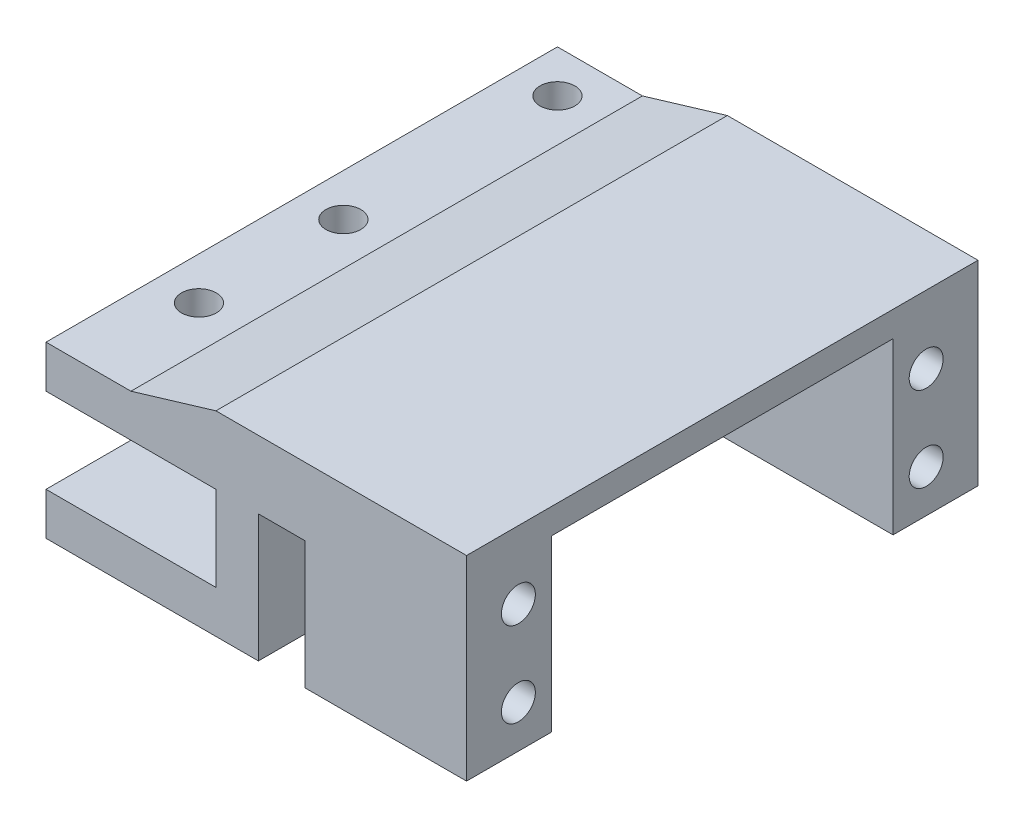
ISO-10303-21;
HEADER;
FILE_DESCRIPTION(('STEP AP214'),'2;1');
FILE_NAME('part.step','',(''),(''),'','','');
FILE_SCHEMA(('AUTOMOTIVE_DESIGN { 1 0 10303 214 1 1 1 1 }'));
ENDSEC;
DATA;
#1=APPLICATION_CONTEXT('core data for automotive mechanical design processes');
#2=APPLICATION_PROTOCOL_DEFINITION('international standard','automotive_design',2000,#1);
#3=PRODUCT_CONTEXT('',#1,'mechanical');
#4=PRODUCT('Part','Part','',(#3));
#5=PRODUCT_RELATED_PRODUCT_CATEGORY('part','',(#4));
#6=PRODUCT_DEFINITION_FORMATION('','',#4);
#7=PRODUCT_DEFINITION_CONTEXT('part definition',#1,'design');
#8=PRODUCT_DEFINITION('design','',#6,#7);
#9=PRODUCT_DEFINITION_SHAPE('','',#8);
#10=(LENGTH_UNIT() NAMED_UNIT(*) SI_UNIT(.MILLI.,.METRE.));
#11=(NAMED_UNIT(*) PLANE_ANGLE_UNIT() SI_UNIT($,.RADIAN.));
#12=(NAMED_UNIT(*) SI_UNIT($,.STERADIAN.) SOLID_ANGLE_UNIT());
#13=UNCERTAINTY_MEASURE_WITH_UNIT(LENGTH_MEASURE(1.E-05),#10,'distance_accuracy_value','');
#14=(GEOMETRIC_REPRESENTATION_CONTEXT(3) GLOBAL_UNCERTAINTY_ASSIGNED_CONTEXT((#13)) GLOBAL_UNIT_ASSIGNED_CONTEXT((#10,
#11,#12)) REPRESENTATION_CONTEXT('',''));
#15=CARTESIAN_POINT('',(0.,0.,0.));
#16=DIRECTION('',(0.,0.,1.));
#17=DIRECTION('',(1.,0.,0.));
#18=AXIS2_PLACEMENT_3D('',#15,#16,#17);
#19=CARTESIAN_POINT('',(0.,0.,10.));
#20=DIRECTION('',(0.,1.,0.));
#21=DIRECTION('',(0.,0.,1.));
#22=AXIS2_PLACEMENT_3D('',#19,#20,#21);
#23=PLANE('',#22);
#24=DIRECTION('',(-1.,0.,0.));
#25=VECTOR('',#24,1.);
#26=CARTESIAN_POINT('',(0.,0.,0.));
#27=LINE('',#26,#25);
#28=CARTESIAN_POINT('',(0.,0.,0.));
#29=VERTEX_POINT('',#28);
#30=CARTESIAN_POINT('',(-19.,0.,0.));
#31=VERTEX_POINT('',#30);
#32=EDGE_CURVE('E239',#29,#31,#27,.T.);
#33=ORIENTED_EDGE('',*,*,#32,.F.);
#34=DIRECTION('',(0.,0.,-1.));
#35=VECTOR('',#34,1.);
#36=CARTESIAN_POINT('',(0.,0.,10.));
#37=LINE('',#36,#35);
#38=CARTESIAN_POINT('',(0.,0.,10.));
#39=VERTEX_POINT('',#38);
#40=EDGE_CURVE('E205',#39,#29,#37,.T.);
#41=ORIENTED_EDGE('',*,*,#40,.F.);
#42=DIRECTION('',(-1.,0.,0.));
#43=VECTOR('',#42,1.);
#44=CARTESIAN_POINT('',(0.,0.,10.));
#45=LINE('',#44,#43);
#46=CARTESIAN_POINT('',(-19.,0.,10.));
#47=VERTEX_POINT('',#46);
#48=EDGE_CURVE('E187',#39,#47,#45,.T.);
#49=ORIENTED_EDGE('',*,*,#48,.T.);
#50=DIRECTION('',(0.,0.,1.));
#51=VECTOR('',#50,1.);
#52=CARTESIAN_POINT('',(-19.,0.,-10.));
#53=LINE('',#52,#51);
#54=EDGE_CURVE('E195',#31,#47,#53,.T.);
#55=ORIENTED_EDGE('',*,*,#54,.F.);
#56=EDGE_LOOP('',(#33,#41,#49,#55));
#57=FACE_BOUND('',#56,.T.);
#58=ADVANCED_FACE('F41',(#57),#23,.F.);
#59=CARTESIAN_POINT('',(0.,0.,0.));
#60=DIRECTION('',(0.,0.,1.));
#61=DIRECTION('',(-1.,0.,0.));
#62=AXIS2_PLACEMENT_3D('',#59,#60,#61);
#63=PLANE('',#62);
#64=DIRECTION('',(1.,0.,0.));
#65=VECTOR('',#64,1.);
#66=CARTESIAN_POINT('',(0.,15.,0.));
#67=LINE('',#66,#65);
#68=CARTESIAN_POINT('',(-24.5,15.,0.));
#69=VERTEX_POINT('',#68);
#70=CARTESIAN_POINT('',(-19.,15.,0.));
#71=VERTEX_POINT('',#70);
#72=EDGE_CURVE('E308',#69,#71,#67,.T.);
#73=ORIENTED_EDGE('',*,*,#72,.F.);
#74=DIRECTION('',(0.,1.,0.));
#75=VECTOR('',#74,1.);
#76=CARTESIAN_POINT('',(-24.5,0.,0.));
#77=LINE('',#76,#75);
#78=CARTESIAN_POINT('',(-24.5,0.,0.));
#79=VERTEX_POINT('',#78);
#80=EDGE_CURVE('E302',#79,#69,#77,.T.);
#81=ORIENTED_EDGE('',*,*,#80,.F.);
#82=CARTESIAN_POINT('',(-29.5,0.,0.));
#83=VERTEX_POINT('',#82);
#84=EDGE_CURVE('E242',#79,#83,#27,.T.);
#85=ORIENTED_EDGE('',*,*,#84,.T.);
#86=DIRECTION('',(0.,1.,0.));
#87=VECTOR('',#86,1.);
#88=CARTESIAN_POINT('',(-29.5,5.,0.));
#89=LINE('',#88,#87);
#90=CARTESIAN_POINT('',(-29.5,5.,0.));
#91=VERTEX_POINT('',#90);
#92=EDGE_CURVE('E367',#83,#91,#89,.T.);
#93=ORIENTED_EDGE('',*,*,#92,.T.);
#94=DIRECTION('',(0.,1.,0.));
#95=VECTOR('',#94,1.);
#96=CARTESIAN_POINT('',(-29.5,15.,0.));
#97=LINE('',#96,#95);
#98=CARTESIAN_POINT('',(-29.5,15.,0.));
#99=VERTEX_POINT('',#98);
#100=EDGE_CURVE('E241',#91,#99,#97,.T.);
#101=ORIENTED_EDGE('',*,*,#100,.T.);
#102=DIRECTION('',(0.,1.,0.));
#103=VECTOR('',#102,1.);
#104=CARTESIAN_POINT('',(-29.5,20.,0.));
#105=LINE('',#104,#103);
#106=CARTESIAN_POINT('',(-29.5,20.,0.));
#107=VERTEX_POINT('',#106);
#108=EDGE_CURVE('E370',#99,#107,#105,.T.);
#109=ORIENTED_EDGE('',*,*,#108,.T.);
#110=DIRECTION('',(1.,0.,0.));
#111=VECTOR('',#110,1.);
#112=CARTESIAN_POINT('',(0.,20.,0.));
#113=LINE('',#112,#111);
#114=CARTESIAN_POINT('',(0.,20.,0.));
#115=VERTEX_POINT('',#114);
#116=EDGE_CURVE('E373',#107,#115,#113,.T.);
#117=ORIENTED_EDGE('',*,*,#116,.T.);
#118=DIRECTION('',(0.,-1.,0.));
#119=VECTOR('',#118,1.);
#120=CARTESIAN_POINT('',(0.,0.,0.));
#121=LINE('',#120,#119);
#122=EDGE_CURVE('E213',#115,#29,#121,.T.);
#123=ORIENTED_EDGE('',*,*,#122,.T.);
#124=ORIENTED_EDGE('',*,*,#32,.T.);
#125=DIRECTION('',(0.,-1.,0.));
#126=VECTOR('',#125,1.);
#127=CARTESIAN_POINT('',(-19.,0.,0.));
#128=LINE('',#127,#126);
#129=EDGE_CURVE('E198',#71,#31,#128,.T.);
#130=ORIENTED_EDGE('',*,*,#129,.F.);
#131=EDGE_LOOP('',(#73,#81,#85,#93,#101,#109,#117,#123,#124,#130));
#132=FACE_BOUND('',#131,.T.);
#133=ADVANCED_FACE('F386',(#132),#63,.F.);
#134=CARTESIAN_POINT('',(-44.5,0.,-3.));
#135=DIRECTION('',(0.,1.,0.));
#136=DIRECTION('',(0.,0.,-1.));
#137=AXIS2_PLACEMENT_3D('',#134,#135,#136);
#138=CIRCLE('',#137,2.04999999999999);
#139=CARTESIAN_POINT('',(-44.5,0.,-5.04999999999999));
#140=VERTEX_POINT('',#139);
#141=EDGE_CURVE('E273',#140,#140,#138,.T.);
#142=ORIENTED_EDGE('',*,*,#141,.T.);
#143=EDGE_LOOP('',(#142));
#144=FACE_BOUND('',#143,.T.);
#145=CARTESIAN_POINT('',(-44.5,0.,-45.2));
#146=DIRECTION('',(0.,1.,0.));
#147=DIRECTION('',(0.,0.,-1.));
#148=AXIS2_PLACEMENT_3D('',#145,#146,#147);
#149=CIRCLE('',#148,2.04999999999999);
#150=CARTESIAN_POINT('',(-44.5,0.,-47.25));
#151=VERTEX_POINT('',#150);
#152=EDGE_CURVE('E443',#151,#151,#149,.T.);
#153=ORIENTED_EDGE('',*,*,#152,.T.);
#154=EDGE_LOOP('',(#153));
#155=FACE_BOUND('',#154,.T.);
#156=CARTESIAN_POINT('',(-44.5,0.,-20.));
#157=DIRECTION('',(0.,1.,0.));
#158=DIRECTION('',(0.,0.,-1.));
#159=AXIS2_PLACEMENT_3D('',#156,#157,#158);
#160=CIRCLE('',#159,2.04999999999999);
#161=CARTESIAN_POINT('',(-44.5,0.,-22.05));
#162=VERTEX_POINT('',#161);
#163=EDGE_CURVE('E446',#162,#162,#160,.T.);
#164=ORIENTED_EDGE('',*,*,#163,.T.);
#165=EDGE_LOOP('',(#164));
#166=FACE_BOUND('',#165,.T.);
#167=CARTESIAN_POINT('',(-24.5,0.,10.));
#168=VERTEX_POINT('',#167);
#169=CARTESIAN_POINT('',(-49.5,0.,10.));
#170=VERTEX_POINT('',#169);
#171=EDGE_CURVE('E207',#168,#170,#45,.T.);
#172=ORIENTED_EDGE('',*,*,#171,.T.);
#173=DIRECTION('',(0.,0.,-1.));
#174=VECTOR('',#173,1.);
#175=CARTESIAN_POINT('',(-49.5,0.,10.));
#176=LINE('',#175,#174);
#177=CARTESIAN_POINT('',(-49.5,0.,-50.2));
#178=VERTEX_POINT('',#177);
#179=EDGE_CURVE('E11',#170,#178,#176,.T.);
#180=ORIENTED_EDGE('',*,*,#179,.T.);
#181=DIRECTION('',(-1.,0.,0.));
#182=VECTOR('',#181,1.);
#183=CARTESIAN_POINT('',(0.,0.,-50.2));
#184=LINE('',#183,#182);
#185=CARTESIAN_POINT('',(0.,0.,-50.2));
#186=VERTEX_POINT('',#185);
#187=EDGE_CURVE('E320',#186,#178,#184,.T.);
#188=ORIENTED_EDGE('',*,*,#187,.F.);
#189=DIRECTION('',(0.,0.,1.));
#190=VECTOR('',#189,1.);
#191=CARTESIAN_POINT('',(0.,0.,-50.2));
#192=LINE('',#191,#190);
#193=CARTESIAN_POINT('',(0.,0.,-40.2));
#194=VERTEX_POINT('',#193);
#195=EDGE_CURVE('E349',#186,#194,#192,.T.);
#196=ORIENTED_EDGE('',*,*,#195,.T.);
#197=DIRECTION('',(-1.,0.,0.));
#198=VECTOR('',#197,1.);
#199=CARTESIAN_POINT('',(0.,0.,-40.2));
#200=LINE('',#199,#198);
#201=CARTESIAN_POINT('',(-29.5,0.,-40.2));
#202=VERTEX_POINT('',#201);
#203=EDGE_CURVE('E319',#194,#202,#200,.T.);
#204=ORIENTED_EDGE('',*,*,#203,.T.);
#205=DIRECTION('',(0.,0.,1.));
#206=VECTOR('',#205,1.);
#207=CARTESIAN_POINT('',(-29.5,0.,-20.1));
#208=LINE('',#207,#206);
#209=EDGE_CURVE('E363',#202,#83,#208,.T.);
#210=ORIENTED_EDGE('',*,*,#209,.T.);
#211=ORIENTED_EDGE('',*,*,#84,.F.);
#212=DIRECTION('',(0.,0.,1.));
#213=VECTOR('',#212,1.);
#214=CARTESIAN_POINT('',(-24.5,0.,-10.));
#215=LINE('',#214,#213);
#216=EDGE_CURVE('E202',#79,#168,#215,.T.);
#217=ORIENTED_EDGE('',*,*,#216,.T.);
#218=EDGE_LOOP('',(#172,#180,#188,#196,#204,#210,#211,#217));
#219=FACE_BOUND('',#218,.T.);
#220=ADVANCED_FACE('F43',(#144,#155,#166,#219),#23,.F.);
#221=CARTESIAN_POINT('',(-49.5,0.,10.));
#222=DIRECTION('',(1.,0.,0.));
#223=DIRECTION('',(0.,0.,1.));
#224=AXIS2_PLACEMENT_3D('',#221,#222,#223);
#225=PLANE('',#224);
#226=ORIENTED_EDGE('',*,*,#179,.F.);
#227=DIRECTION('',(0.,1.,0.));
#228=VECTOR('',#227,1.);
#229=CARTESIAN_POINT('',(-49.5,0.,10.));
#230=LINE('',#229,#228);
#231=CARTESIAN_POINT('',(-49.5,5.,10.));
#232=VERTEX_POINT('',#231);
#233=EDGE_CURVE('E206',#170,#232,#230,.T.);
#234=ORIENTED_EDGE('',*,*,#233,.T.);
#235=DIRECTION('',(0.,0.,-1.));
#236=VECTOR('',#235,1.);
#237=CARTESIAN_POINT('',(-49.5,5.,10.));
#238=LINE('',#237,#236);
#239=CARTESIAN_POINT('',(-49.5,5.,-50.2));
#240=VERTEX_POINT('',#239);
#241=EDGE_CURVE('E50',#232,#240,#238,.T.);
#242=ORIENTED_EDGE('',*,*,#241,.T.);
#243=DIRECTION('',(0.,1.,0.));
#244=VECTOR('',#243,1.);
#245=CARTESIAN_POINT('',(-49.5,0.,-50.2));
#246=LINE('',#245,#244);
#247=EDGE_CURVE('E323',#178,#240,#246,.T.);
#248=ORIENTED_EDGE('',*,*,#247,.F.);
#249=EDGE_LOOP('',(#226,#234,#242,#248));
#250=FACE_BOUND('',#249,.T.);
#251=ADVANCED_FACE('F431',(#250),#225,.F.);
#252=CARTESIAN_POINT('',(-29.5,5.,10.));
#253=DIRECTION('',(0.,-1.,0.));
#254=DIRECTION('',(-1.,0.,0.));
#255=AXIS2_PLACEMENT_3D('',#252,#253,#254);
#256=PLANE('',#255);
#257=CARTESIAN_POINT('',(-44.5,5.,-3.));
#258=DIRECTION('',(0.,1.,0.));
#259=DIRECTION('',(-1.,0.,0.));
#260=AXIS2_PLACEMENT_3D('',#257,#258,#259);
#261=CIRCLE('',#260,2.04999999999999);
#262=CARTESIAN_POINT('',(-46.55,5.,-3.));
#263=VERTEX_POINT('',#262);
#264=EDGE_CURVE('E192',#263,#263,#261,.T.);
#265=ORIENTED_EDGE('',*,*,#264,.F.);
#266=EDGE_LOOP('',(#265));
#267=FACE_BOUND('',#266,.T.);
#268=CARTESIAN_POINT('',(-44.5,5.,-45.2));
#269=DIRECTION('',(0.,1.,0.));
#270=DIRECTION('',(-1.,0.,0.));
#271=AXIS2_PLACEMENT_3D('',#268,#269,#270);
#272=CIRCLE('',#271,2.04999999999999);
#273=CARTESIAN_POINT('',(-46.55,5.,-45.2));
#274=VERTEX_POINT('',#273);
#275=EDGE_CURVE('E281',#274,#274,#272,.T.);
#276=ORIENTED_EDGE('',*,*,#275,.F.);
#277=EDGE_LOOP('',(#276));
#278=FACE_BOUND('',#277,.T.);
#279=CARTESIAN_POINT('',(-44.5,5.,-20.));
#280=DIRECTION('',(0.,1.,0.));
#281=DIRECTION('',(-1.,0.,0.));
#282=AXIS2_PLACEMENT_3D('',#279,#280,#281);
#283=CIRCLE('',#282,2.04999999999999);
#284=CARTESIAN_POINT('',(-46.55,5.,-20.));
#285=VERTEX_POINT('',#284);
#286=EDGE_CURVE('E277',#285,#285,#283,.T.);
#287=ORIENTED_EDGE('',*,*,#286,.F.);
#288=EDGE_LOOP('',(#287));
#289=FACE_BOUND('',#288,.T.);
#290=ORIENTED_EDGE('',*,*,#241,.F.);
#291=DIRECTION('',(1.,0.,0.));
#292=VECTOR('',#291,1.);
#293=CARTESIAN_POINT('',(-29.5,5.,10.));
#294=LINE('',#293,#292);
#295=CARTESIAN_POINT('',(-29.5,5.,10.));
#296=VERTEX_POINT('',#295);
#297=EDGE_CURVE('E210',#232,#296,#294,.T.);
#298=ORIENTED_EDGE('',*,*,#297,.T.);
#299=DIRECTION('',(0.,0.,-1.));
#300=VECTOR('',#299,1.);
#301=CARTESIAN_POINT('',(-29.5,5.,10.));
#302=LINE('',#301,#300);
#303=EDGE_CURVE('E265',#296,#91,#302,.T.);
#304=ORIENTED_EDGE('',*,*,#303,.T.);
#305=DIRECTION('',(0.,0.,1.));
#306=VECTOR('',#305,1.);
#307=CARTESIAN_POINT('',(-29.5,5.,-20.1));
#308=LINE('',#307,#306);
#309=CARTESIAN_POINT('',(-29.5,5.,-40.2));
#310=VERTEX_POINT('',#309);
#311=EDGE_CURVE('E365',#310,#91,#308,.T.);
#312=ORIENTED_EDGE('',*,*,#311,.F.);
#313=DIRECTION('',(0.,0.,1.));
#314=VECTOR('',#313,1.);
#315=CARTESIAN_POINT('',(-29.5,5.,-50.2));
#316=LINE('',#315,#314);
#317=CARTESIAN_POINT('',(-29.5,5.,-50.2));
#318=VERTEX_POINT('',#317);
#319=EDGE_CURVE('E360',#318,#310,#316,.T.);
#320=ORIENTED_EDGE('',*,*,#319,.F.);
#321=DIRECTION('',(1.,0.,0.));
#322=VECTOR('',#321,1.);
#323=CARTESIAN_POINT('',(-29.5,5.,-50.2));
#324=LINE('',#323,#322);
#325=EDGE_CURVE('E327',#240,#318,#324,.T.);
#326=ORIENTED_EDGE('',*,*,#325,.F.);
#327=EDGE_LOOP('',(#290,#298,#304,#312,#320,#326));
#328=FACE_BOUND('',#327,.T.);
#329=ADVANCED_FACE('F400',(#267,#278,#289,#328),#256,.F.);
#330=CARTESIAN_POINT('',(-29.5,15.,10.));
#331=DIRECTION('',(1.,0.,0.));
#332=DIRECTION('',(0.,-1.,0.));
#333=AXIS2_PLACEMENT_3D('',#330,#331,#332);
#334=PLANE('',#333);
#335=ORIENTED_EDGE('',*,*,#100,.F.);
#336=ORIENTED_EDGE('',*,*,#303,.F.);
#337=DIRECTION('',(0.,1.,0.));
#338=VECTOR('',#337,1.);
#339=CARTESIAN_POINT('',(-29.5,15.,10.));
#340=LINE('',#339,#338);
#341=CARTESIAN_POINT('',(-29.5,15.,10.));
#342=VERTEX_POINT('',#341);
#343=EDGE_CURVE('E219',#296,#342,#340,.T.);
#344=ORIENTED_EDGE('',*,*,#343,.T.);
#345=DIRECTION('',(0.,0.,-1.));
#346=VECTOR('',#345,1.);
#347=CARTESIAN_POINT('',(-29.5,15.,10.));
#348=LINE('',#347,#346);
#349=EDGE_CURVE('E262',#342,#99,#348,.T.);
#350=ORIENTED_EDGE('',*,*,#349,.T.);
#351=EDGE_LOOP('',(#335,#336,#344,#350));
#352=FACE_BOUND('',#351,.T.);
#353=ADVANCED_FACE('F402',(#352),#334,.F.);
#354=CARTESIAN_POINT('',(-49.5,15.,10.));
#355=DIRECTION('',(0.,1.,0.));
#356=DIRECTION('',(1.,0.,0.));
#357=AXIS2_PLACEMENT_3D('',#354,#355,#356);
#358=PLANE('',#357);
#359=CARTESIAN_POINT('',(-44.5,15.,-3.));
#360=DIRECTION('',(0.,-1.,0.));
#361=DIRECTION('',(1.,0.,0.));
#362=AXIS2_PLACEMENT_3D('',#359,#360,#361);
#363=CIRCLE('',#362,2.04999999999999);
#364=CARTESIAN_POINT('',(-42.45,15.,-3.));
#365=VERTEX_POINT('',#364);
#366=EDGE_CURVE('E293',#365,#365,#363,.T.);
#367=ORIENTED_EDGE('',*,*,#366,.F.);
#368=EDGE_LOOP('',(#367));
#369=FACE_BOUND('',#368,.T.);
#370=CARTESIAN_POINT('',(-44.5,15.,-45.2));
#371=DIRECTION('',(0.,-1.,0.));
#372=DIRECTION('',(1.,0.,0.));
#373=AXIS2_PLACEMENT_3D('',#370,#371,#372);
#374=CIRCLE('',#373,2.04999999999999);
#375=CARTESIAN_POINT('',(-42.45,15.,-45.2));
#376=VERTEX_POINT('',#375);
#377=EDGE_CURVE('E276',#376,#376,#374,.T.);
#378=ORIENTED_EDGE('',*,*,#377,.F.);
#379=EDGE_LOOP('',(#378));
#380=FACE_BOUND('',#379,.T.);
#381=CARTESIAN_POINT('',(-44.5,15.,-20.));
#382=DIRECTION('',(0.,-1.,0.));
#383=DIRECTION('',(1.,0.,0.));
#384=AXIS2_PLACEMENT_3D('',#381,#382,#383);
#385=CIRCLE('',#384,2.04999999999999);
#386=CARTESIAN_POINT('',(-42.45,15.,-20.));
#387=VERTEX_POINT('',#386);
#388=EDGE_CURVE('E272',#387,#387,#385,.T.);
#389=ORIENTED_EDGE('',*,*,#388,.F.);
#390=EDGE_LOOP('',(#389));
#391=FACE_BOUND('',#390,.T.);
#392=ORIENTED_EDGE('',*,*,#349,.F.);
#393=DIRECTION('',(-1.,0.,0.));
#394=VECTOR('',#393,1.);
#395=CARTESIAN_POINT('',(-49.5,15.,10.));
#396=LINE('',#395,#394);
#397=CARTESIAN_POINT('',(-49.5,15.,10.));
#398=VERTEX_POINT('',#397);
#399=EDGE_CURVE('E222',#342,#398,#396,.T.);
#400=ORIENTED_EDGE('',*,*,#399,.T.);
#401=DIRECTION('',(0.,0.,-1.));
#402=VECTOR('',#401,1.);
#403=CARTESIAN_POINT('',(-49.5,15.,10.));
#404=LINE('',#403,#402);
#405=CARTESIAN_POINT('',(-49.5,15.,-50.2));
#406=VERTEX_POINT('',#405);
#407=EDGE_CURVE('E259',#398,#406,#404,.T.);
#408=ORIENTED_EDGE('',*,*,#407,.T.);
#409=DIRECTION('',(-1.,0.,0.));
#410=VECTOR('',#409,1.);
#411=CARTESIAN_POINT('',(-49.5,15.,-50.2));
#412=LINE('',#411,#410);
#413=CARTESIAN_POINT('',(-29.5,15.,-50.2));
#414=VERTEX_POINT('',#413);
#415=EDGE_CURVE('E332',#414,#406,#412,.T.);
#416=ORIENTED_EDGE('',*,*,#415,.F.);
#417=DIRECTION('',(0.,0.,1.));
#418=VECTOR('',#417,1.);
#419=CARTESIAN_POINT('',(-29.5,15.,-50.2));
#420=LINE('',#419,#418);
#421=CARTESIAN_POINT('',(-29.5,15.,-40.2));
#422=VERTEX_POINT('',#421);
#423=EDGE_CURVE('E357',#414,#422,#420,.T.);
#424=ORIENTED_EDGE('',*,*,#423,.T.);
#425=DIRECTION('',(0.,0.,1.));
#426=VECTOR('',#425,1.);
#427=CARTESIAN_POINT('',(-29.5,15.,-20.1));
#428=LINE('',#427,#426);
#429=EDGE_CURVE('E376',#422,#99,#428,.T.);
#430=ORIENTED_EDGE('',*,*,#429,.T.);
#431=EDGE_LOOP('',(#392,#400,#408,#416,#424,#430));
#432=FACE_BOUND('',#431,.T.);
#433=ADVANCED_FACE('F410',(#369,#380,#391,#432),#358,.F.);
#434=CARTESIAN_POINT('',(-49.5,15.,10.));
#435=DIRECTION('',(1.,0.,0.));
#436=DIRECTION('',(0.,0.,1.));
#437=AXIS2_PLACEMENT_3D('',#434,#435,#436);
#438=PLANE('',#437);
#439=ORIENTED_EDGE('',*,*,#407,.F.);
#440=DIRECTION('',(0.,1.,0.));
#441=VECTOR('',#440,1.);
#442=CARTESIAN_POINT('',(-49.5,15.,10.));
#443=LINE('',#442,#441);
#444=CARTESIAN_POINT('',(-49.5,20.,10.));
#445=VERTEX_POINT('',#444);
#446=EDGE_CURVE('E225',#398,#445,#443,.T.);
#447=ORIENTED_EDGE('',*,*,#446,.T.);
#448=DIRECTION('',(0.,0.,-1.));
#449=VECTOR('',#448,1.);
#450=CARTESIAN_POINT('',(-49.5,20.,10.));
#451=LINE('',#450,#449);
#452=CARTESIAN_POINT('',(-49.5,20.,-50.2));
#453=VERTEX_POINT('',#452);
#454=EDGE_CURVE('E256',#445,#453,#451,.T.);
#455=ORIENTED_EDGE('',*,*,#454,.T.);
#456=DIRECTION('',(0.,1.,0.));
#457=VECTOR('',#456,1.);
#458=CARTESIAN_POINT('',(-49.5,15.,-50.2));
#459=LINE('',#458,#457);
#460=EDGE_CURVE('E335',#406,#453,#459,.T.);
#461=ORIENTED_EDGE('',*,*,#460,.F.);
#462=EDGE_LOOP('',(#439,#447,#455,#461));
#463=FACE_BOUND('',#462,.T.);
#464=ADVANCED_FACE('F508',(#463),#438,.F.);
#465=CARTESIAN_POINT('',(-49.5,20.,10.));
#466=DIRECTION('',(0.,-1.,0.));
#467=DIRECTION('',(0.,0.,-1.));
#468=AXIS2_PLACEMENT_3D('',#465,#466,#467);
#469=PLANE('',#468);
#470=CARTESIAN_POINT('',(-44.5,20.,-3.));
#471=DIRECTION('',(0.,1.,0.));
#472=DIRECTION('',(0.,0.,-1.));
#473=AXIS2_PLACEMENT_3D('',#470,#471,#472);
#474=CIRCLE('',#473,2.04999999999999);
#475=CARTESIAN_POINT('',(-44.5,20.,-5.04999999999999));
#476=VERTEX_POINT('',#475);
#477=EDGE_CURVE('E45',#476,#476,#474,.T.);
#478=ORIENTED_EDGE('',*,*,#477,.F.);
#479=EDGE_LOOP('',(#478));
#480=FACE_BOUND('',#479,.T.);
#481=CARTESIAN_POINT('',(-44.5,20.,-45.2));
#482=DIRECTION('',(0.,1.,0.));
#483=DIRECTION('',(0.,0.,-1.));
#484=AXIS2_PLACEMENT_3D('',#481,#482,#483);
#485=CIRCLE('',#484,2.04999999999999);
#486=CARTESIAN_POINT('',(-44.5,20.,-47.25));
#487=VERTEX_POINT('',#486);
#488=EDGE_CURVE('E274',#487,#487,#485,.T.);
#489=ORIENTED_EDGE('',*,*,#488,.F.);
#490=EDGE_LOOP('',(#489));
#491=FACE_BOUND('',#490,.T.);
#492=CARTESIAN_POINT('',(-44.5,20.,-20.));
#493=DIRECTION('',(0.,1.,0.));
#494=DIRECTION('',(0.,0.,-1.));
#495=AXIS2_PLACEMENT_3D('',#492,#493,#494);
#496=CIRCLE('',#495,2.04999999999999);
#497=CARTESIAN_POINT('',(-44.5,20.,-22.05));
#498=VERTEX_POINT('',#497);
#499=EDGE_CURVE('E270',#498,#498,#496,.T.);
#500=ORIENTED_EDGE('',*,*,#499,.F.);
#501=EDGE_LOOP('',(#500));
#502=FACE_BOUND('',#501,.T.);
#503=ORIENTED_EDGE('',*,*,#454,.F.);
#504=DIRECTION('',(1.,0.,0.));
#505=VECTOR('',#504,1.);
#506=CARTESIAN_POINT('',(-49.5,20.,10.));
#507=LINE('',#506,#505);
#508=CARTESIAN_POINT('',(-39.5,20.,10.));
#509=VERTEX_POINT('',#508);
#510=EDGE_CURVE('E228',#445,#509,#507,.T.);
#511=ORIENTED_EDGE('',*,*,#510,.T.);
#512=DIRECTION('',(0.,0.,-1.));
#513=VECTOR('',#512,1.);
#514=CARTESIAN_POINT('',(-39.5,20.,10.));
#515=LINE('',#514,#513);
#516=CARTESIAN_POINT('',(-39.5,20.,-50.2));
#517=VERTEX_POINT('',#516);
#518=EDGE_CURVE('E253',#509,#517,#515,.T.);
#519=ORIENTED_EDGE('',*,*,#518,.T.);
#520=DIRECTION('',(1.,0.,0.));
#521=VECTOR('',#520,1.);
#522=CARTESIAN_POINT('',(-49.5,20.,-50.2));
#523=LINE('',#522,#521);
#524=EDGE_CURVE('E338',#453,#517,#523,.T.);
#525=ORIENTED_EDGE('',*,*,#524,.F.);
#526=EDGE_LOOP('',(#503,#511,#519,#525));
#527=FACE_BOUND('',#526,.T.);
#528=ADVANCED_FACE('F505',(#480,#491,#502,#527),#469,.F.);
#529=CARTESIAN_POINT('',(-39.5,20.,10.));
#530=DIRECTION('',(0.287347885566345,-0.957826285221152,0.));
#531=DIRECTION('',(-0.957826285221152,-0.287347885566345,0.));
#532=AXIS2_PLACEMENT_3D('',#529,#530,#531);
#533=PLANE('',#532);
#534=ORIENTED_EDGE('',*,*,#518,.F.);
#535=DIRECTION('',(0.957826285221152,0.287347885566345,0.));
#536=VECTOR('',#535,1.);
#537=CARTESIAN_POINT('',(-39.5,20.,10.));
#538=LINE('',#537,#536);
#539=CARTESIAN_POINT('',(-29.5,23.,10.));
#540=VERTEX_POINT('',#539);
#541=EDGE_CURVE('E231',#509,#540,#538,.T.);
#542=ORIENTED_EDGE('',*,*,#541,.T.);
#543=DIRECTION('',(0.,0.,-1.));
#544=VECTOR('',#543,1.);
#545=CARTESIAN_POINT('',(-29.5,23.,10.));
#546=LINE('',#545,#544);
#547=CARTESIAN_POINT('',(-29.5,23.,-50.2));
#548=VERTEX_POINT('',#547);
#549=EDGE_CURVE('E250',#540,#548,#546,.T.);
#550=ORIENTED_EDGE('',*,*,#549,.T.);
#551=DIRECTION('',(0.957826285221152,0.287347885566345,0.));
#552=VECTOR('',#551,1.);
#553=CARTESIAN_POINT('',(-39.5,20.,-50.2));
#554=LINE('',#553,#552);
#555=EDGE_CURVE('E341',#517,#548,#554,.T.);
#556=ORIENTED_EDGE('',*,*,#555,.F.);
#557=EDGE_LOOP('',(#534,#542,#550,#556));
#558=FACE_BOUND('',#557,.T.);
#559=ADVANCED_FACE('F503',(#558),#533,.F.);
#560=CARTESIAN_POINT('',(0.,23.,10.));
#561=DIRECTION('',(0.,-1.,0.));
#562=DIRECTION('',(0.,0.,-1.));
#563=AXIS2_PLACEMENT_3D('',#560,#561,#562);
#564=PLANE('',#563);
#565=ORIENTED_EDGE('',*,*,#549,.F.);
#566=DIRECTION('',(1.,0.,0.));
#567=VECTOR('',#566,1.);
#568=CARTESIAN_POINT('',(0.,23.,10.));
#569=LINE('',#568,#567);
#570=CARTESIAN_POINT('',(0.,23.,10.));
#571=VERTEX_POINT('',#570);
#572=EDGE_CURVE('E234',#540,#571,#569,.T.);
#573=ORIENTED_EDGE('',*,*,#572,.T.);
#574=DIRECTION('',(0.,0.,-1.));
#575=VECTOR('',#574,1.);
#576=CARTESIAN_POINT('',(0.,23.,10.));
#577=LINE('',#576,#575);
#578=CARTESIAN_POINT('',(0.,23.,-50.2));
#579=VERTEX_POINT('',#578);
#580=EDGE_CURVE('E247',#571,#579,#577,.T.);
#581=ORIENTED_EDGE('',*,*,#580,.T.);
#582=DIRECTION('',(1.,0.,0.));
#583=VECTOR('',#582,1.);
#584=CARTESIAN_POINT('',(0.,23.,-50.2));
#585=LINE('',#584,#583);
#586=EDGE_CURVE('E344',#548,#579,#585,.T.);
#587=ORIENTED_EDGE('',*,*,#586,.F.);
#588=EDGE_LOOP('',(#565,#573,#581,#587));
#589=FACE_BOUND('',#588,.T.);
#590=ADVANCED_FACE('F488',(#589),#564,.F.);
#591=CARTESIAN_POINT('',(0.,0.,10.));
#592=DIRECTION('',(-1.,0.,0.));
#593=DIRECTION('',(0.,0.,-1.));
#594=AXIS2_PLACEMENT_3D('',#591,#592,#593);
#595=PLANE('',#594);
#596=CARTESIAN_POINT('',(0.,5.,-44.1));
#597=DIRECTION('',(1.,0.,0.));
#598=DIRECTION('',(0.,0.,-1.));
#599=AXIS2_PLACEMENT_3D('',#596,#597,#598);
#600=CIRCLE('',#599,2.);
#601=CARTESIAN_POINT('',(0.,5.,-46.1));
#602=VERTEX_POINT('',#601);
#603=EDGE_CURVE('E470',#602,#602,#600,.T.);
#604=ORIENTED_EDGE('',*,*,#603,.F.);
#605=EDGE_LOOP('',(#604));
#606=FACE_BOUND('',#605,.T.);
#607=CARTESIAN_POINT('',(0.,15.,-44.1));
#608=DIRECTION('',(1.,0.,0.));
#609=DIRECTION('',(0.,0.,-1.));
#610=AXIS2_PLACEMENT_3D('',#607,#608,#609);
#611=CIRCLE('',#610,2.);
#612=CARTESIAN_POINT('',(0.,15.,-46.1));
#613=VERTEX_POINT('',#612);
#614=EDGE_CURVE('E464',#613,#613,#611,.T.);
#615=ORIENTED_EDGE('',*,*,#614,.F.);
#616=EDGE_LOOP('',(#615));
#617=FACE_BOUND('',#616,.T.);
#618=CARTESIAN_POINT('',(0.,5.,3.9));
#619=DIRECTION('',(-1.,0.,0.));
#620=DIRECTION('',(0.,0.,1.));
#621=AXIS2_PLACEMENT_3D('',#618,#619,#620);
#622=CIRCLE('',#621,2.);
#623=CARTESIAN_POINT('',(0.,5.,5.9));
#624=VERTEX_POINT('',#623);
#625=EDGE_CURVE('E451',#624,#624,#622,.T.);
#626=ORIENTED_EDGE('',*,*,#625,.T.);
#627=EDGE_LOOP('',(#626));
#628=FACE_BOUND('',#627,.T.);
#629=CARTESIAN_POINT('',(0.,15.,3.9));
#630=DIRECTION('',(-1.,0.,0.));
#631=DIRECTION('',(0.,0.,1.));
#632=AXIS2_PLACEMENT_3D('',#629,#630,#631);
#633=CIRCLE('',#632,2.);
#634=CARTESIAN_POINT('',(0.,15.,5.9));
#635=VERTEX_POINT('',#634);
#636=EDGE_CURVE('E458',#635,#635,#633,.T.);
#637=ORIENTED_EDGE('',*,*,#636,.T.);
#638=EDGE_LOOP('',(#637));
#639=FACE_BOUND('',#638,.T.);
#640=ORIENTED_EDGE('',*,*,#580,.F.);
#641=DIRECTION('',(0.,-1.,0.));
#642=VECTOR('',#641,1.);
#643=CARTESIAN_POINT('',(0.,0.,10.));
#644=LINE('',#643,#642);
#645=EDGE_CURVE('E237',#571,#39,#644,.T.);
#646=ORIENTED_EDGE('',*,*,#645,.T.);
#647=ORIENTED_EDGE('',*,*,#40,.T.);
#648=ORIENTED_EDGE('',*,*,#122,.F.);
#649=DIRECTION('',(0.,0.,1.));
#650=VECTOR('',#649,1.);
#651=CARTESIAN_POINT('',(0.,20.,-20.1));
#652=LINE('',#651,#650);
#653=CARTESIAN_POINT('',(0.,20.,-40.2));
#654=VERTEX_POINT('',#653);
#655=EDGE_CURVE('E377',#654,#115,#652,.T.);
#656=ORIENTED_EDGE('',*,*,#655,.F.);
#657=DIRECTION('',(0.,-1.,0.));
#658=VECTOR('',#657,1.);
#659=CARTESIAN_POINT('',(0.,0.,-40.2));
#660=LINE('',#659,#658);
#661=EDGE_CURVE('E324',#654,#194,#660,.T.);
#662=ORIENTED_EDGE('',*,*,#661,.T.);
#663=ORIENTED_EDGE('',*,*,#195,.F.);
#664=DIRECTION('',(0.,-1.,0.));
#665=VECTOR('',#664,1.);
#666=CARTESIAN_POINT('',(0.,0.,-50.2));
#667=LINE('',#666,#665);
#668=EDGE_CURVE('E347',#579,#186,#667,.T.);
#669=ORIENTED_EDGE('',*,*,#668,.F.);
#670=EDGE_LOOP('',(#640,#646,#647,#648,#656,#662,#663,#669));
#671=FACE_BOUND('',#670,.T.);
#672=ADVANCED_FACE('F485',(#606,#617,#628,#639,#671),#595,.F.);
#673=CARTESIAN_POINT('',(0.,0.,10.));
#674=DIRECTION('',(0.,0.,1.));
#675=DIRECTION('',(-1.,0.,0.));
#676=AXIS2_PLACEMENT_3D('',#673,#674,#675);
#677=PLANE('',#676);
#678=DIRECTION('',(0.,-1.,0.));
#679=VECTOR('',#678,1.);
#680=CARTESIAN_POINT('',(-19.,0.,10.));
#681=LINE('',#680,#679);
#682=CARTESIAN_POINT('',(-19.,15.,10.));
#683=VERTEX_POINT('',#682);
#684=EDGE_CURVE('E183',#683,#47,#681,.T.);
#685=ORIENTED_EDGE('',*,*,#684,.T.);
#686=ORIENTED_EDGE('',*,*,#48,.F.);
#687=ORIENTED_EDGE('',*,*,#645,.F.);
#688=ORIENTED_EDGE('',*,*,#572,.F.);
#689=ORIENTED_EDGE('',*,*,#541,.F.);
#690=ORIENTED_EDGE('',*,*,#510,.F.);
#691=ORIENTED_EDGE('',*,*,#446,.F.);
#692=ORIENTED_EDGE('',*,*,#399,.F.);
#693=ORIENTED_EDGE('',*,*,#343,.F.);
#694=ORIENTED_EDGE('',*,*,#297,.F.);
#695=ORIENTED_EDGE('',*,*,#233,.F.);
#696=ORIENTED_EDGE('',*,*,#171,.F.);
#697=DIRECTION('',(0.,1.,0.));
#698=VECTOR('',#697,1.);
#699=CARTESIAN_POINT('',(-24.5,0.,10.));
#700=LINE('',#699,#698);
#701=CARTESIAN_POINT('',(-24.5,15.,10.));
#702=VERTEX_POINT('',#701);
#703=EDGE_CURVE('E58',#168,#702,#700,.T.);
#704=ORIENTED_EDGE('',*,*,#703,.T.);
#705=DIRECTION('',(1.,0.,0.));
#706=VECTOR('',#705,1.);
#707=CARTESIAN_POINT('',(-19.,15.,10.));
#708=LINE('',#707,#706);
#709=EDGE_CURVE('E190',#702,#683,#708,.T.);
#710=ORIENTED_EDGE('',*,*,#709,.T.);
#711=EDGE_LOOP('',(#685,#686,#687,#688,#689,#690,#691,#692,#693,#694,#695,#696,#704,#710));
#712=FACE_BOUND('',#711,.T.);
#713=ADVANCED_FACE('F185',(#712),#677,.T.);
#714=CARTESIAN_POINT('',(-29.5,20.,-20.1));
#715=DIRECTION('',(-1.,0.,0.));
#716=DIRECTION('',(0.,0.,-1.));
#717=AXIS2_PLACEMENT_3D('',#714,#715,#716);
#718=PLANE('',#717);
#719=ORIENTED_EDGE('',*,*,#108,.F.);
#720=ORIENTED_EDGE('',*,*,#429,.F.);
#721=DIRECTION('',(0.,1.,0.));
#722=VECTOR('',#721,1.);
#723=CARTESIAN_POINT('',(-29.5,20.,-40.2));
#724=LINE('',#723,#722);
#725=CARTESIAN_POINT('',(-29.5,20.,-40.2));
#726=VERTEX_POINT('',#725);
#727=EDGE_CURVE('E315',#422,#726,#724,.T.);
#728=ORIENTED_EDGE('',*,*,#727,.T.);
#729=DIRECTION('',(0.,0.,1.));
#730=VECTOR('',#729,1.);
#731=CARTESIAN_POINT('',(-29.5,20.,-20.1));
#732=LINE('',#731,#730);
#733=EDGE_CURVE('E66',#726,#107,#732,.T.);
#734=ORIENTED_EDGE('',*,*,#733,.T.);
#735=EDGE_LOOP('',(#719,#720,#728,#734));
#736=FACE_BOUND('',#735,.T.);
#737=ADVANCED_FACE('F405',(#736),#718,.F.);
#738=CARTESIAN_POINT('',(0.,20.,-20.1));
#739=DIRECTION('',(0.,1.,0.));
#740=DIRECTION('',(0.,0.,1.));
#741=AXIS2_PLACEMENT_3D('',#738,#739,#740);
#742=PLANE('',#741);
#743=ORIENTED_EDGE('',*,*,#116,.F.);
#744=ORIENTED_EDGE('',*,*,#733,.F.);
#745=DIRECTION('',(1.,0.,0.));
#746=VECTOR('',#745,1.);
#747=CARTESIAN_POINT('',(0.,20.,-40.2));
#748=LINE('',#747,#746);
#749=EDGE_CURVE('E317',#726,#654,#748,.T.);
#750=ORIENTED_EDGE('',*,*,#749,.T.);
#751=ORIENTED_EDGE('',*,*,#655,.T.);
#752=EDGE_LOOP('',(#743,#744,#750,#751));
#753=FACE_BOUND('',#752,.T.);
#754=ADVANCED_FACE('F416',(#753),#742,.F.);
#755=CARTESIAN_POINT('',(-29.5,5.,-20.1));
#756=DIRECTION('',(-1.,0.,0.));
#757=DIRECTION('',(0.,0.,-1.));
#758=AXIS2_PLACEMENT_3D('',#755,#756,#757);
#759=PLANE('',#758);
#760=ORIENTED_EDGE('',*,*,#92,.F.);
#761=ORIENTED_EDGE('',*,*,#209,.F.);
#762=DIRECTION('',(0.,1.,0.));
#763=VECTOR('',#762,1.);
#764=CARTESIAN_POINT('',(-29.5,5.,-40.2));
#765=LINE('',#764,#763);
#766=EDGE_CURVE('E312',#202,#310,#765,.T.);
#767=ORIENTED_EDGE('',*,*,#766,.T.);
#768=ORIENTED_EDGE('',*,*,#311,.T.);
#769=EDGE_LOOP('',(#760,#761,#767,#768));
#770=FACE_BOUND('',#769,.T.);
#771=ADVANCED_FACE('F393',(#770),#759,.F.);
#772=CARTESIAN_POINT('',(0.,0.,-40.2));
#773=DIRECTION('',(0.,0.,-1.));
#774=DIRECTION('',(-1.,0.,0.));
#775=AXIS2_PLACEMENT_3D('',#772,#773,#774);
#776=PLANE('',#775);
#777=ORIENTED_EDGE('',*,*,#766,.F.);
#778=ORIENTED_EDGE('',*,*,#203,.F.);
#779=ORIENTED_EDGE('',*,*,#661,.F.);
#780=ORIENTED_EDGE('',*,*,#749,.F.);
#781=ORIENTED_EDGE('',*,*,#727,.F.);
#782=DIRECTION('',(0.,1.,0.));
#783=VECTOR('',#782,1.);
#784=CARTESIAN_POINT('',(-29.5,15.,-40.2));
#785=LINE('',#784,#783);
#786=EDGE_CURVE('E352',#310,#422,#785,.T.);
#787=ORIENTED_EDGE('',*,*,#786,.F.);
#788=EDGE_LOOP('',(#777,#778,#779,#780,#781,#787));
#789=FACE_BOUND('',#788,.T.);
#790=ADVANCED_FACE('F414',(#789),#776,.F.);
#791=CARTESIAN_POINT('',(-29.5,15.,-50.2));
#792=DIRECTION('',(1.,0.,0.));
#793=DIRECTION('',(0.,-1.,0.));
#794=AXIS2_PLACEMENT_3D('',#791,#792,#793);
#795=PLANE('',#794);
#796=ORIENTED_EDGE('',*,*,#786,.T.);
#797=ORIENTED_EDGE('',*,*,#423,.F.);
#798=DIRECTION('',(0.,1.,0.));
#799=VECTOR('',#798,1.);
#800=CARTESIAN_POINT('',(-29.5,15.,-50.2));
#801=LINE('',#800,#799);
#802=EDGE_CURVE('E330',#318,#414,#801,.T.);
#803=ORIENTED_EDGE('',*,*,#802,.F.);
#804=ORIENTED_EDGE('',*,*,#319,.T.);
#805=EDGE_LOOP('',(#796,#797,#803,#804));
#806=FACE_BOUND('',#805,.T.);
#807=ADVANCED_FACE('F412',(#806),#795,.F.);
#808=CARTESIAN_POINT('',(0.,0.,-50.2));
#809=DIRECTION('',(0.,0.,-1.));
#810=DIRECTION('',(-1.,0.,0.));
#811=AXIS2_PLACEMENT_3D('',#808,#809,#810);
#812=PLANE('',#811);
#813=ORIENTED_EDGE('',*,*,#187,.T.);
#814=ORIENTED_EDGE('',*,*,#247,.T.);
#815=ORIENTED_EDGE('',*,*,#325,.T.);
#816=ORIENTED_EDGE('',*,*,#802,.T.);
#817=ORIENTED_EDGE('',*,*,#415,.T.);
#818=ORIENTED_EDGE('',*,*,#460,.T.);
#819=ORIENTED_EDGE('',*,*,#524,.T.);
#820=ORIENTED_EDGE('',*,*,#555,.T.);
#821=ORIENTED_EDGE('',*,*,#586,.T.);
#822=ORIENTED_EDGE('',*,*,#668,.T.);
#823=EDGE_LOOP('',(#813,#814,#815,#816,#817,#818,#819,#820,#821,#822));
#824=FACE_BOUND('',#823,.T.);
#825=ADVANCED_FACE('F512',(#824),#812,.T.);
#826=CARTESIAN_POINT('',(-19.,0.,-10.));
#827=DIRECTION('',(1.,0.,0.));
#828=DIRECTION('',(0.,0.,1.));
#829=AXIS2_PLACEMENT_3D('',#826,#827,#828);
#830=PLANE('',#829);
#831=DIRECTION('',(0.,0.,1.));
#832=VECTOR('',#831,1.);
#833=CARTESIAN_POINT('',(-19.,15.,-10.));
#834=LINE('',#833,#832);
#835=EDGE_CURVE('E300',#71,#683,#834,.T.);
#836=ORIENTED_EDGE('',*,*,#835,.F.);
#837=ORIENTED_EDGE('',*,*,#129,.T.);
#838=ORIENTED_EDGE('',*,*,#54,.T.);
#839=ORIENTED_EDGE('',*,*,#684,.F.);
#840=EDGE_LOOP('',(#836,#837,#838,#839));
#841=FACE_BOUND('',#840,.T.);
#842=ADVANCED_FACE('F196',(#841),#830,.F.);
#843=CARTESIAN_POINT('',(-19.,15.,-10.));
#844=DIRECTION('',(0.,1.,0.));
#845=DIRECTION('',(0.,0.,1.));
#846=AXIS2_PLACEMENT_3D('',#843,#844,#845);
#847=PLANE('',#846);
#848=DIRECTION('',(0.,0.,1.));
#849=VECTOR('',#848,1.);
#850=CARTESIAN_POINT('',(-24.5,15.,-10.));
#851=LINE('',#850,#849);
#852=EDGE_CURVE('E303',#69,#702,#851,.T.);
#853=ORIENTED_EDGE('',*,*,#852,.F.);
#854=ORIENTED_EDGE('',*,*,#72,.T.);
#855=ORIENTED_EDGE('',*,*,#835,.T.);
#856=ORIENTED_EDGE('',*,*,#709,.F.);
#857=EDGE_LOOP('',(#853,#854,#855,#856));
#858=FACE_BOUND('',#857,.T.);
#859=ADVANCED_FACE('F514',(#858),#847,.F.);
#860=CARTESIAN_POINT('',(-24.5,0.,-10.));
#861=DIRECTION('',(-1.,0.,0.));
#862=DIRECTION('',(0.,0.,-1.));
#863=AXIS2_PLACEMENT_3D('',#860,#861,#862);
#864=PLANE('',#863);
#865=ORIENTED_EDGE('',*,*,#216,.F.);
#866=ORIENTED_EDGE('',*,*,#80,.T.);
#867=ORIENTED_EDGE('',*,*,#852,.T.);
#868=ORIENTED_EDGE('',*,*,#703,.F.);
#869=EDGE_LOOP('',(#865,#866,#867,#868));
#870=FACE_BOUND('',#869,.T.);
#871=ADVANCED_FACE('F515',(#870),#864,.F.);
#872=CARTESIAN_POINT('',(-44.5,50.,-20.));
#873=DIRECTION('',(0.,-1.,0.));
#874=DIRECTION('',(0.,0.,-1.));
#875=AXIS2_PLACEMENT_3D('',#872,#873,#874);
#876=CYLINDRICAL_SURFACE('',#875,2.04999999999999);
#877=ORIENTED_EDGE('',*,*,#499,.T.);
#878=EDGE_LOOP('',(#877));
#879=FACE_BOUND('',#878,.T.);
#880=ORIENTED_EDGE('',*,*,#388,.T.);
#881=EDGE_LOOP('',(#880));
#882=FACE_BOUND('',#881,.T.);
#883=ADVANCED_FACE('F517',(#879,#882),#876,.F.);
#884=CARTESIAN_POINT('',(-44.5,50.,-45.2));
#885=DIRECTION('',(0.,-1.,0.));
#886=DIRECTION('',(0.,0.,-1.));
#887=AXIS2_PLACEMENT_3D('',#884,#885,#886);
#888=CYLINDRICAL_SURFACE('',#887,2.04999999999999);
#889=ORIENTED_EDGE('',*,*,#488,.T.);
#890=EDGE_LOOP('',(#889));
#891=FACE_BOUND('',#890,.T.);
#892=ORIENTED_EDGE('',*,*,#377,.T.);
#893=EDGE_LOOP('',(#892));
#894=FACE_BOUND('',#893,.T.);
#895=ADVANCED_FACE('F523',(#891,#894),#888,.F.);
#896=CARTESIAN_POINT('',(-44.5,50.,-3.));
#897=DIRECTION('',(0.,-1.,0.));
#898=DIRECTION('',(0.,0.,-1.));
#899=AXIS2_PLACEMENT_3D('',#896,#897,#898);
#900=CYLINDRICAL_SURFACE('',#899,2.04999999999999);
#901=ORIENTED_EDGE('',*,*,#477,.T.);
#902=EDGE_LOOP('',(#901));
#903=FACE_BOUND('',#902,.T.);
#904=ORIENTED_EDGE('',*,*,#366,.T.);
#905=EDGE_LOOP('',(#904));
#906=FACE_BOUND('',#905,.T.);
#907=ADVANCED_FACE('F574',(#903,#906),#900,.F.);
#908=ORIENTED_EDGE('',*,*,#163,.F.);
#909=EDGE_LOOP('',(#908));
#910=FACE_BOUND('',#909,.T.);
#911=ORIENTED_EDGE('',*,*,#286,.T.);
#912=EDGE_LOOP('',(#911));
#913=FACE_BOUND('',#912,.T.);
#914=ADVANCED_FACE('F526',(#910,#913),#876,.F.);
#915=ORIENTED_EDGE('',*,*,#152,.F.);
#916=EDGE_LOOP('',(#915));
#917=FACE_BOUND('',#916,.T.);
#918=ORIENTED_EDGE('',*,*,#275,.T.);
#919=EDGE_LOOP('',(#918));
#920=FACE_BOUND('',#919,.T.);
#921=ADVANCED_FACE('F576',(#917,#920),#888,.F.);
#922=ORIENTED_EDGE('',*,*,#141,.F.);
#923=EDGE_LOOP('',(#922));
#924=FACE_BOUND('',#923,.T.);
#925=ORIENTED_EDGE('',*,*,#264,.T.);
#926=EDGE_LOOP('',(#925));
#927=FACE_BOUND('',#926,.T.);
#928=ADVANCED_FACE('F587',(#924,#927),#900,.F.);
#929=CARTESIAN_POINT('',(-10.,15.,3.9));
#930=DIRECTION('',(1.,0.,0.));
#931=DIRECTION('',(0.,0.,1.));
#932=AXIS2_PLACEMENT_3D('',#929,#930,#931);
#933=CYLINDRICAL_SURFACE('',#932,2.);
#934=CARTESIAN_POINT('',(-10.,15.,3.9));
#935=DIRECTION('',(-1.,0.,0.));
#936=DIRECTION('',(0.,0.,1.));
#937=AXIS2_PLACEMENT_3D('',#934,#935,#936);
#938=CIRCLE('',#937,2.);
#939=CARTESIAN_POINT('',(-10.,15.,5.9));
#940=VERTEX_POINT('',#939);
#941=EDGE_CURVE('E455',#940,#940,#938,.T.);
#942=ORIENTED_EDGE('',*,*,#941,.T.);
#943=EDGE_LOOP('',(#942));
#944=FACE_BOUND('',#943,.T.);
#945=ORIENTED_EDGE('',*,*,#636,.F.);
#946=EDGE_LOOP('',(#945));
#947=FACE_BOUND('',#946,.T.);
#948=ADVANCED_FACE('F613',(#944,#947),#933,.F.);
#949=CARTESIAN_POINT('',(-10.,15.,3.9));
#950=DIRECTION('',(1.,0.,0.));
#951=DIRECTION('',(0.,0.,1.));
#952=AXIS2_PLACEMENT_3D('',#949,#950,#951);
#953=PLANE('',#952);
#954=ORIENTED_EDGE('',*,*,#941,.F.);
#955=EDGE_LOOP('',(#954));
#956=FACE_BOUND('',#955,.T.);
#957=ADVANCED_FACE('F623',(#956),#953,.T.);
#958=CARTESIAN_POINT('',(-10.,5.,3.9));
#959=DIRECTION('',(1.,0.,0.));
#960=DIRECTION('',(0.,0.,1.));
#961=AXIS2_PLACEMENT_3D('',#958,#959,#960);
#962=CYLINDRICAL_SURFACE('',#961,2.);
#963=CARTESIAN_POINT('',(-10.,5.,3.9));
#964=DIRECTION('',(-1.,0.,0.));
#965=DIRECTION('',(0.,0.,1.));
#966=AXIS2_PLACEMENT_3D('',#963,#964,#965);
#967=CIRCLE('',#966,2.);
#968=CARTESIAN_POINT('',(-10.,5.,5.9));
#969=VERTEX_POINT('',#968);
#970=EDGE_CURVE('E448',#969,#969,#967,.T.);
#971=ORIENTED_EDGE('',*,*,#970,.T.);
#972=EDGE_LOOP('',(#971));
#973=FACE_BOUND('',#972,.T.);
#974=ORIENTED_EDGE('',*,*,#625,.F.);
#975=EDGE_LOOP('',(#974));
#976=FACE_BOUND('',#975,.T.);
#977=ADVANCED_FACE('F634',(#973,#976),#962,.F.);
#978=CARTESIAN_POINT('',(-10.,5.,3.9));
#979=DIRECTION('',(1.,0.,0.));
#980=DIRECTION('',(0.,0.,1.));
#981=AXIS2_PLACEMENT_3D('',#978,#979,#980);
#982=PLANE('',#981);
#983=ORIENTED_EDGE('',*,*,#970,.F.);
#984=EDGE_LOOP('',(#983));
#985=FACE_BOUND('',#984,.T.);
#986=ADVANCED_FACE('F645',(#985),#982,.T.);
#987=CARTESIAN_POINT('',(-10.,15.,-44.1));
#988=DIRECTION('',(1.,0.,0.));
#989=DIRECTION('',(0.,0.,1.));
#990=AXIS2_PLACEMENT_3D('',#987,#988,#989);
#991=CYLINDRICAL_SURFACE('',#990,2.);
#992=CARTESIAN_POINT('',(-10.,15.,-44.1));
#993=DIRECTION('',(1.,0.,0.));
#994=DIRECTION('',(0.,0.,-1.));
#995=AXIS2_PLACEMENT_3D('',#992,#993,#994);
#996=CIRCLE('',#995,2.);
#997=CARTESIAN_POINT('',(-10.,15.,-46.1));
#998=VERTEX_POINT('',#997);
#999=EDGE_CURVE('E467',#998,#998,#996,.T.);
#1000=ORIENTED_EDGE('',*,*,#999,.F.);
#1001=EDGE_LOOP('',(#1000));
#1002=FACE_BOUND('',#1001,.T.);
#1003=ORIENTED_EDGE('',*,*,#614,.T.);
#1004=EDGE_LOOP('',(#1003));
#1005=FACE_BOUND('',#1004,.T.);
#1006=ADVANCED_FACE('F656',(#1002,#1005),#991,.F.);
#1007=CARTESIAN_POINT('',(-10.,15.,-44.1));
#1008=DIRECTION('',(1.,0.,0.));
#1009=DIRECTION('',(0.,0.,-1.));
#1010=AXIS2_PLACEMENT_3D('',#1007,#1008,#1009);
#1011=PLANE('',#1010);
#1012=ORIENTED_EDGE('',*,*,#999,.T.);
#1013=EDGE_LOOP('',(#1012));
#1014=FACE_BOUND('',#1013,.T.);
#1015=ADVANCED_FACE('F481',(#1014),#1011,.T.);
#1016=CARTESIAN_POINT('',(-10.,5.,-44.1));
#1017=DIRECTION('',(1.,0.,0.));
#1018=DIRECTION('',(0.,0.,1.));
#1019=AXIS2_PLACEMENT_3D('',#1016,#1017,#1018);
#1020=CYLINDRICAL_SURFACE('',#1019,2.);
#1021=CARTESIAN_POINT('',(-10.,5.,-44.1));
#1022=DIRECTION('',(1.,0.,0.));
#1023=DIRECTION('',(0.,0.,-1.));
#1024=AXIS2_PLACEMENT_3D('',#1021,#1022,#1023);
#1025=CIRCLE('',#1024,2.);
#1026=CARTESIAN_POINT('',(-10.,5.,-46.1));
#1027=VERTEX_POINT('',#1026);
#1028=EDGE_CURVE('E459',#1027,#1027,#1025,.T.);
#1029=ORIENTED_EDGE('',*,*,#1028,.F.);
#1030=EDGE_LOOP('',(#1029));
#1031=FACE_BOUND('',#1030,.T.);
#1032=ORIENTED_EDGE('',*,*,#603,.T.);
#1033=EDGE_LOOP('',(#1032));
#1034=FACE_BOUND('',#1033,.T.);
#1035=ADVANCED_FACE('F478',(#1031,#1034),#1020,.F.);
#1036=CARTESIAN_POINT('',(-10.,5.,-44.1));
#1037=DIRECTION('',(1.,0.,0.));
#1038=DIRECTION('',(0.,0.,-1.));
#1039=AXIS2_PLACEMENT_3D('',#1036,#1037,#1038);
#1040=PLANE('',#1039);
#1041=ORIENTED_EDGE('',*,*,#1028,.T.);
#1042=EDGE_LOOP('',(#1041));
#1043=FACE_BOUND('',#1042,.T.);
#1044=ADVANCED_FACE('F476',(#1043),#1040,.T.);
#1045=CLOSED_SHELL('',(#58,#133,#220,#251,#329,#353,#433,#464,#528,#559,#590,#672,#713,#737,
#754,#771,#790,#807,#825,#842,#859,#871,#883,#895,#907,#914,#921,#928,#948,#957,#977,#986,#1006,
#1015,#1035,#1044));
#1046=MANIFOLD_SOLID_BREP('B2',#1045);
#1047=ADVANCED_BREP_SHAPE_REPRESENTATION('',(#18,#1046),#14);
#1048=SHAPE_DEFINITION_REPRESENTATION(#9,#1047);
ENDSEC;
END-ISO-10303-21;
